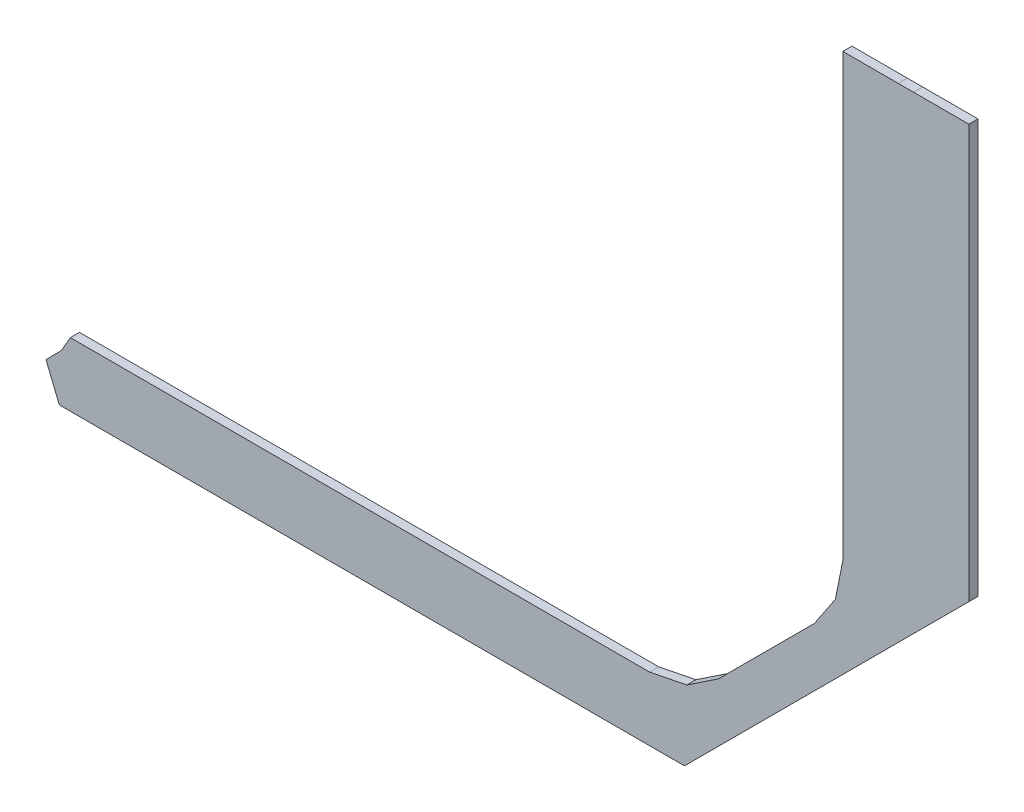
ISO-10303-21;
HEADER;
FILE_DESCRIPTION(('STEP AP214'),'2;1');
FILE_NAME('part.step','',(''),(''),'','','');
FILE_SCHEMA(('AUTOMOTIVE_DESIGN { 1 0 10303 214 1 1 1 1 }'));
ENDSEC;
DATA;
#1=APPLICATION_CONTEXT('core data for automotive mechanical design processes');
#2=APPLICATION_PROTOCOL_DEFINITION('international standard','automotive_design',2000,#1);
#3=PRODUCT_CONTEXT('',#1,'mechanical');
#4=PRODUCT('Part','Part','',(#3));
#5=PRODUCT_RELATED_PRODUCT_CATEGORY('part','',(#4));
#6=PRODUCT_DEFINITION_FORMATION('','',#4);
#7=PRODUCT_DEFINITION_CONTEXT('part definition',#1,'design');
#8=PRODUCT_DEFINITION('design','',#6,#7);
#9=PRODUCT_DEFINITION_SHAPE('','',#8);
#10=(LENGTH_UNIT() NAMED_UNIT(*) SI_UNIT(.MILLI.,.METRE.));
#11=(NAMED_UNIT(*) PLANE_ANGLE_UNIT() SI_UNIT($,.RADIAN.));
#12=(NAMED_UNIT(*) SI_UNIT($,.STERADIAN.) SOLID_ANGLE_UNIT());
#13=UNCERTAINTY_MEASURE_WITH_UNIT(LENGTH_MEASURE(1.E-05),#10,'distance_accuracy_value','');
#14=(GEOMETRIC_REPRESENTATION_CONTEXT(3) GLOBAL_UNCERTAINTY_ASSIGNED_CONTEXT((#13)) GLOBAL_UNIT_ASSIGNED_CONTEXT((#10,
#11,#12)) REPRESENTATION_CONTEXT('',''));
#15=CARTESIAN_POINT('',(0.,0.,0.));
#16=DIRECTION('',(0.,0.,1.));
#17=DIRECTION('',(1.,0.,0.));
#18=AXIS2_PLACEMENT_3D('',#15,#16,#17);
#19=CARTESIAN_POINT('',(91.6630020141601,74.3830032348633,0.));
#20=DIRECTION('',(0.,-1.,0.));
#21=DIRECTION('',(-1.,0.,0.));
#22=AXIS2_PLACEMENT_3D('',#19,#20,#21);
#23=PLANE('',#22);
#24=DIRECTION('',(-1.,0.,0.));
#25=VECTOR('',#24,1.);
#26=CARTESIAN_POINT('',(91.6630020141601,74.3830032348633,0.03556));
#27=LINE('',#26,#25);
#28=CARTESIAN_POINT('',(91.6630020141601,74.3830032348633,0.03556));
#29=VERTEX_POINT('',#28);
#30=CARTESIAN_POINT('',(91.4469985961914,74.3830032348633,0.03556));
#31=VERTEX_POINT('',#30);
#32=EDGE_CURVE('E11',#29,#31,#27,.T.);
#33=ORIENTED_EDGE('',*,*,#32,.F.);
#34=DIRECTION('',(0.,0.,1.));
#35=VECTOR('',#34,1.);
#36=CARTESIAN_POINT('',(91.6630020141601,74.3830032348633,0.));
#37=LINE('',#36,#35);
#38=CARTESIAN_POINT('',(91.6630020141601,74.3830032348633,0.));
#39=VERTEX_POINT('',#38);
#40=EDGE_CURVE('E24',#39,#29,#37,.T.);
#41=ORIENTED_EDGE('',*,*,#40,.F.);
#42=DIRECTION('',(-1.,0.,0.));
#43=VECTOR('',#42,1.);
#44=CARTESIAN_POINT('',(91.6630020141601,74.3830032348633,0.));
#45=LINE('',#44,#43);
#46=CARTESIAN_POINT('',(91.4469985961914,74.3830032348633,0.));
#47=VERTEX_POINT('',#46);
#48=EDGE_CURVE('E148',#39,#47,#45,.T.);
#49=ORIENTED_EDGE('',*,*,#48,.T.);
#50=DIRECTION('',(0.,0.,1.));
#51=VECTOR('',#50,1.);
#52=CARTESIAN_POINT('',(91.4469985961914,74.3830032348633,0.));
#53=LINE('',#52,#51);
#54=EDGE_CURVE('E37',#47,#31,#53,.T.);
#55=ORIENTED_EDGE('',*,*,#54,.T.);
#56=EDGE_LOOP('',(#33,#41,#49,#55));
#57=FACE_BOUND('',#56,.T.);
#58=ADVANCED_FACE('F17',(#57),#23,.F.);
#59=CARTESIAN_POINT('',(91.4469985961914,74.3830032348633,0.));
#60=DIRECTION('',(0.,-1.,0.));
#61=DIRECTION('',(-1.,0.,0.));
#62=AXIS2_PLACEMENT_3D('',#59,#60,#61);
#63=PLANE('',#62);
#64=DIRECTION('',(-1.,0.,0.));
#65=VECTOR('',#64,1.);
#66=CARTESIAN_POINT('',(91.4469985961914,74.3830032348633,0.03556));
#67=LINE('',#66,#65);
#68=CARTESIAN_POINT('',(91.3870010375977,74.3830032348633,0.03556));
#69=VERTEX_POINT('',#68);
#70=EDGE_CURVE('E252',#31,#69,#67,.T.);
#71=ORIENTED_EDGE('',*,*,#70,.F.);
#72=ORIENTED_EDGE('',*,*,#54,.F.);
#73=DIRECTION('',(-1.,0.,0.));
#74=VECTOR('',#73,1.);
#75=CARTESIAN_POINT('',(91.4469985961914,74.3830032348633,0.));
#76=LINE('',#75,#74);
#77=CARTESIAN_POINT('',(91.3870010375977,74.3830032348633,0.));
#78=VERTEX_POINT('',#77);
#79=EDGE_CURVE('E249',#47,#78,#76,.T.);
#80=ORIENTED_EDGE('',*,*,#79,.T.);
#81=DIRECTION('',(0.,0.,1.));
#82=VECTOR('',#81,1.);
#83=CARTESIAN_POINT('',(91.3870010375977,74.3830032348633,0.));
#84=LINE('',#83,#82);
#85=EDGE_CURVE('E247',#78,#69,#84,.T.);
#86=ORIENTED_EDGE('',*,*,#85,.T.);
#87=EDGE_LOOP('',(#71,#72,#80,#86));
#88=FACE_BOUND('',#87,.T.);
#89=ADVANCED_FACE('F260',(#88),#63,.F.);
#90=CARTESIAN_POINT('',(91.3870010375977,74.3830032348633,0.));
#91=DIRECTION('',(0.,-1.,0.));
#92=DIRECTION('',(-1.,0.,0.));
#93=AXIS2_PLACEMENT_3D('',#90,#91,#92);
#94=PLANE('',#93);
#95=DIRECTION('',(-1.,0.,0.));
#96=VECTOR('',#95,1.);
#97=CARTESIAN_POINT('',(91.3870010375977,74.3830032348633,0.03556));
#98=LINE('',#97,#96);
#99=CARTESIAN_POINT('',(91.1709976196289,74.3830032348633,0.03556));
#100=VERTEX_POINT('',#99);
#101=EDGE_CURVE('E244',#69,#100,#98,.T.);
#102=ORIENTED_EDGE('',*,*,#101,.F.);
#103=ORIENTED_EDGE('',*,*,#85,.F.);
#104=DIRECTION('',(-1.,0.,0.));
#105=VECTOR('',#104,1.);
#106=CARTESIAN_POINT('',(91.3870010375977,74.3830032348633,0.));
#107=LINE('',#106,#105);
#108=CARTESIAN_POINT('',(91.1709976196289,74.3830032348633,0.));
#109=VERTEX_POINT('',#108);
#110=EDGE_CURVE('E241',#78,#109,#107,.T.);
#111=ORIENTED_EDGE('',*,*,#110,.T.);
#112=DIRECTION('',(0.,0.,1.));
#113=VECTOR('',#112,1.);
#114=CARTESIAN_POINT('',(91.1709976196289,74.3830032348633,0.));
#115=LINE('',#114,#113);
#116=EDGE_CURVE('E239',#109,#100,#115,.T.);
#117=ORIENTED_EDGE('',*,*,#116,.T.);
#118=EDGE_LOOP('',(#102,#103,#111,#117));
#119=FACE_BOUND('',#118,.T.);
#120=ADVANCED_FACE('F266',(#119),#94,.F.);
#121=CARTESIAN_POINT('',(91.1709976196289,74.3830032348633,0.));
#122=DIRECTION('',(1.,0.,0.));
#123=DIRECTION('',(0.,-1.,0.));
#124=AXIS2_PLACEMENT_3D('',#121,#122,#123);
#125=PLANE('',#124);
#126=DIRECTION('',(0.,-1.,0.));
#127=VECTOR('',#126,1.);
#128=CARTESIAN_POINT('',(91.1709976196289,74.3830032348633,0.03556));
#129=LINE('',#128,#127);
#130=CARTESIAN_POINT('',(91.1709976196289,72.6620025634766,0.03556));
#131=VERTEX_POINT('',#130);
#132=EDGE_CURVE('E236',#100,#131,#129,.T.);
#133=ORIENTED_EDGE('',*,*,#132,.F.);
#134=ORIENTED_EDGE('',*,*,#116,.F.);
#135=DIRECTION('',(0.,-1.,0.));
#136=VECTOR('',#135,1.);
#137=CARTESIAN_POINT('',(91.1709976196289,74.3830032348633,0.));
#138=LINE('',#137,#136);
#139=CARTESIAN_POINT('',(91.1709976196289,72.6620025634766,0.));
#140=VERTEX_POINT('',#139);
#141=EDGE_CURVE('E233',#109,#140,#138,.T.);
#142=ORIENTED_EDGE('',*,*,#141,.T.);
#143=DIRECTION('',(0.,0.,1.));
#144=VECTOR('',#143,1.);
#145=CARTESIAN_POINT('',(91.1709976196289,72.6620025634766,0.));
#146=LINE('',#145,#144);
#147=EDGE_CURVE('E231',#140,#131,#146,.T.);
#148=ORIENTED_EDGE('',*,*,#147,.T.);
#149=EDGE_LOOP('',(#133,#134,#142,#148));
#150=FACE_BOUND('',#149,.T.);
#151=ADVANCED_FACE('F268',(#150),#125,.F.);
#152=CARTESIAN_POINT('',(91.1709976196289,72.6620025634766,0.));
#153=DIRECTION('',(0.980582659999227,-0.196106213335634,0.));
#154=DIRECTION('',(-0.196106213335634,-0.980582659999227,0.));
#155=AXIS2_PLACEMENT_3D('',#152,#153,#154);
#156=PLANE('',#155);
#157=DIRECTION('',(-0.196106213335634,-0.980582659999227,0.));
#158=VECTOR('',#157,1.);
#159=CARTESIAN_POINT('',(91.1709976196289,72.6620025634766,0.03556));
#160=LINE('',#159,#158);
#161=CARTESIAN_POINT('',(91.1419982910156,72.5169982910156,0.03556));
#162=VERTEX_POINT('',#161);
#163=EDGE_CURVE('E228',#131,#162,#160,.T.);
#164=ORIENTED_EDGE('',*,*,#163,.F.);
#165=ORIENTED_EDGE('',*,*,#147,.F.);
#166=DIRECTION('',(-0.196106213335634,-0.980582659999227,0.));
#167=VECTOR('',#166,1.);
#168=CARTESIAN_POINT('',(91.1709976196289,72.6620025634766,0.));
#169=LINE('',#168,#167);
#170=CARTESIAN_POINT('',(91.1419982910156,72.5169982910156,0.));
#171=VERTEX_POINT('',#170);
#172=EDGE_CURVE('E225',#140,#171,#169,.T.);
#173=ORIENTED_EDGE('',*,*,#172,.T.);
#174=DIRECTION('',(0.,0.,1.));
#175=VECTOR('',#174,1.);
#176=CARTESIAN_POINT('',(91.1419982910156,72.5169982910156,0.));
#177=LINE('',#176,#175);
#178=EDGE_CURVE('E223',#171,#162,#177,.T.);
#179=ORIENTED_EDGE('',*,*,#178,.T.);
#180=EDGE_LOOP('',(#164,#165,#173,#179));
#181=FACE_BOUND('',#180,.T.);
#182=ADVANCED_FACE('F273',(#181),#156,.F.);
#183=CARTESIAN_POINT('',(91.1419982910156,72.5169982910156,0.));
#184=DIRECTION('',(0.832050294337844,-0.554700196225229,0.));
#185=DIRECTION('',(-0.554700196225229,-0.832050294337844,0.));
#186=AXIS2_PLACEMENT_3D('',#183,#184,#185);
#187=PLANE('',#186);
#188=DIRECTION('',(-0.554700196225229,-0.832050294337844,0.));
#189=VECTOR('',#188,1.);
#190=CARTESIAN_POINT('',(91.1419982910156,72.5169982910156,0.03556));
#191=LINE('',#190,#189);
#192=CARTESIAN_POINT('',(91.0599975585938,72.3939971923828,0.03556));
#193=VERTEX_POINT('',#192);
#194=EDGE_CURVE('E220',#162,#193,#191,.T.);
#195=ORIENTED_EDGE('',*,*,#194,.F.);
#196=ORIENTED_EDGE('',*,*,#178,.F.);
#197=DIRECTION('',(-0.554700196225229,-0.832050294337844,0.));
#198=VECTOR('',#197,1.);
#199=CARTESIAN_POINT('',(91.1419982910156,72.5169982910156,0.));
#200=LINE('',#199,#198);
#201=CARTESIAN_POINT('',(91.0599975585938,72.3939971923828,0.));
#202=VERTEX_POINT('',#201);
#203=EDGE_CURVE('E217',#171,#202,#200,.T.);
#204=ORIENTED_EDGE('',*,*,#203,.T.);
#205=DIRECTION('',(0.,0.,1.));
#206=VECTOR('',#205,1.);
#207=CARTESIAN_POINT('',(91.0599975585938,72.3939971923828,0.));
#208=LINE('',#207,#206);
#209=EDGE_CURVE('E215',#202,#193,#208,.T.);
#210=ORIENTED_EDGE('',*,*,#209,.T.);
#211=EDGE_LOOP('',(#195,#196,#204,#210));
#212=FACE_BOUND('',#211,.T.);
#213=ADVANCED_FACE('F276',(#212),#187,.F.);
#214=CARTESIAN_POINT('',(91.0599975585938,72.3939971923828,0.));
#215=DIRECTION('',(0.707106781186548,-0.707106781186548,0.));
#216=DIRECTION('',(-0.707106781186548,-0.707106781186548,0.));
#217=AXIS2_PLACEMENT_3D('',#214,#215,#216);
#218=PLANE('',#217);
#219=DIRECTION('',(-0.707106781186548,-0.707106781186548,0.));
#220=VECTOR('',#219,1.);
#221=CARTESIAN_POINT('',(91.0599975585938,72.3939971923828,0.03556));
#222=LINE('',#221,#220);
#223=CARTESIAN_POINT('',(90.6849975585938,72.0189971923828,0.03556));
#224=VERTEX_POINT('',#223);
#225=EDGE_CURVE('E212',#193,#224,#222,.T.);
#226=ORIENTED_EDGE('',*,*,#225,.F.);
#227=ORIENTED_EDGE('',*,*,#209,.F.);
#228=DIRECTION('',(-0.707106781186548,-0.707106781186548,0.));
#229=VECTOR('',#228,1.);
#230=CARTESIAN_POINT('',(91.0599975585938,72.3939971923828,0.));
#231=LINE('',#230,#229);
#232=CARTESIAN_POINT('',(90.6849975585938,72.0189971923828,0.));
#233=VERTEX_POINT('',#232);
#234=EDGE_CURVE('E209',#202,#233,#231,.T.);
#235=ORIENTED_EDGE('',*,*,#234,.T.);
#236=DIRECTION('',(0.,0.,1.));
#237=VECTOR('',#236,1.);
#238=CARTESIAN_POINT('',(90.6849975585938,72.0189971923828,0.));
#239=LINE('',#238,#237);
#240=EDGE_CURVE('E207',#233,#224,#239,.T.);
#241=ORIENTED_EDGE('',*,*,#240,.T.);
#242=EDGE_LOOP('',(#226,#227,#235,#241));
#243=FACE_BOUND('',#242,.T.);
#244=ADVANCED_FACE('F281',(#243),#218,.F.);
#245=CARTESIAN_POINT('',(90.6849975585938,72.0189971923828,0.));
#246=DIRECTION('',(0.554700196225229,-0.832050294337844,0.));
#247=DIRECTION('',(-0.832050294337844,-0.554700196225229,0.));
#248=AXIS2_PLACEMENT_3D('',#245,#246,#247);
#249=PLANE('',#248);
#250=DIRECTION('',(-0.832050294337844,-0.554700196225229,0.));
#251=VECTOR('',#250,1.);
#252=CARTESIAN_POINT('',(90.6849975585938,72.0189971923828,0.03556));
#253=LINE('',#252,#251);
#254=CARTESIAN_POINT('',(90.5619964599609,71.9369964599609,0.03556));
#255=VERTEX_POINT('',#254);
#256=EDGE_CURVE('E204',#224,#255,#253,.T.);
#257=ORIENTED_EDGE('',*,*,#256,.F.);
#258=ORIENTED_EDGE('',*,*,#240,.F.);
#259=DIRECTION('',(-0.832050294337844,-0.554700196225229,0.));
#260=VECTOR('',#259,1.);
#261=CARTESIAN_POINT('',(90.6849975585938,72.0189971923828,0.));
#262=LINE('',#261,#260);
#263=CARTESIAN_POINT('',(90.5619964599609,71.9369964599609,0.));
#264=VERTEX_POINT('',#263);
#265=EDGE_CURVE('E201',#233,#264,#262,.T.);
#266=ORIENTED_EDGE('',*,*,#265,.T.);
#267=DIRECTION('',(0.,0.,1.));
#268=VECTOR('',#267,1.);
#269=CARTESIAN_POINT('',(90.5619964599609,71.9369964599609,0.));
#270=LINE('',#269,#268);
#271=EDGE_CURVE('E199',#264,#255,#270,.T.);
#272=ORIENTED_EDGE('',*,*,#271,.T.);
#273=EDGE_LOOP('',(#257,#258,#266,#272));
#274=FACE_BOUND('',#273,.T.);
#275=ADVANCED_FACE('F284',(#274),#249,.F.);
#276=CARTESIAN_POINT('',(90.5619964599609,71.9369964599609,0.));
#277=DIRECTION('',(0.196116135138184,-0.98058067569092,0.));
#278=DIRECTION('',(-0.98058067569092,-0.196116135138184,0.));
#279=AXIS2_PLACEMENT_3D('',#276,#277,#278);
#280=PLANE('',#279);
#281=DIRECTION('',(-0.98058067569092,-0.196116135138184,0.));
#282=VECTOR('',#281,1.);
#283=CARTESIAN_POINT('',(90.5619964599609,71.9369964599609,0.03556));
#284=LINE('',#283,#282);
#285=CARTESIAN_POINT('',(90.4169998168945,71.9079971313477,0.03556));
#286=VERTEX_POINT('',#285);
#287=EDGE_CURVE('E196',#255,#286,#284,.T.);
#288=ORIENTED_EDGE('',*,*,#287,.F.);
#289=ORIENTED_EDGE('',*,*,#271,.F.);
#290=DIRECTION('',(-0.98058067569092,-0.196116135138184,0.));
#291=VECTOR('',#290,1.);
#292=CARTESIAN_POINT('',(90.5619964599609,71.9369964599609,0.));
#293=LINE('',#292,#291);
#294=CARTESIAN_POINT('',(90.4169998168945,71.9079971313477,0.));
#295=VERTEX_POINT('',#294);
#296=EDGE_CURVE('E193',#264,#295,#293,.T.);
#297=ORIENTED_EDGE('',*,*,#296,.T.);
#298=DIRECTION('',(0.,0.,1.));
#299=VECTOR('',#298,1.);
#300=CARTESIAN_POINT('',(90.4169998168945,71.9079971313477,0.));
#301=LINE('',#300,#299);
#302=EDGE_CURVE('E191',#295,#286,#301,.T.);
#303=ORIENTED_EDGE('',*,*,#302,.T.);
#304=EDGE_LOOP('',(#288,#289,#297,#303));
#305=FACE_BOUND('',#304,.T.);
#306=ADVANCED_FACE('F289',(#305),#280,.F.);
#307=CARTESIAN_POINT('',(90.4169998168945,71.9079971313477,0.));
#308=DIRECTION('',(0.,-1.,0.));
#309=DIRECTION('',(-1.,0.,0.));
#310=AXIS2_PLACEMENT_3D('',#307,#308,#309);
#311=PLANE('',#310);
#312=DIRECTION('',(-1.,0.,0.));
#313=VECTOR('',#312,1.);
#314=CARTESIAN_POINT('',(90.4169998168945,71.9079971313477,0.03556));
#315=LINE('',#314,#313);
#316=CARTESIAN_POINT('',(88.1559982299805,71.9079971313477,0.03556));
#317=VERTEX_POINT('',#316);
#318=EDGE_CURVE('E188',#286,#317,#315,.T.);
#319=ORIENTED_EDGE('',*,*,#318,.F.);
#320=ORIENTED_EDGE('',*,*,#302,.F.);
#321=DIRECTION('',(-1.,0.,0.));
#322=VECTOR('',#321,1.);
#323=CARTESIAN_POINT('',(90.4169998168945,71.9079971313477,0.));
#324=LINE('',#323,#322);
#325=CARTESIAN_POINT('',(88.1559982299805,71.9079971313477,0.));
#326=VERTEX_POINT('',#325);
#327=EDGE_CURVE('E185',#295,#326,#324,.T.);
#328=ORIENTED_EDGE('',*,*,#327,.T.);
#329=DIRECTION('',(0.,0.,1.));
#330=VECTOR('',#329,1.);
#331=CARTESIAN_POINT('',(88.1559982299805,71.9079971313477,0.));
#332=LINE('',#331,#330);
#333=EDGE_CURVE('E183',#326,#317,#332,.T.);
#334=ORIENTED_EDGE('',*,*,#333,.T.);
#335=EDGE_LOOP('',(#319,#320,#328,#334));
#336=FACE_BOUND('',#335,.T.);
#337=ADVANCED_FACE('F292',(#336),#311,.F.);
#338=CARTESIAN_POINT('',(88.1559982299805,71.9079971313477,0.));
#339=DIRECTION('',(0.867380587258325,-0.497645372577103,0.));
#340=DIRECTION('',(-0.497645372577103,-0.867380587258325,0.));
#341=AXIS2_PLACEMENT_3D('',#338,#339,#340);
#342=PLANE('',#341);
#343=DIRECTION('',(-0.497645372577103,-0.867380587258325,0.));
#344=VECTOR('',#343,1.);
#345=CARTESIAN_POINT('',(88.1559982299805,71.9079971313477,0.03556));
#346=LINE('',#345,#344);
#347=CARTESIAN_POINT('',(88.1210021972656,71.8470001220703,0.03556));
#348=VERTEX_POINT('',#347);
#349=EDGE_CURVE('E180',#317,#348,#346,.T.);
#350=ORIENTED_EDGE('',*,*,#349,.F.);
#351=ORIENTED_EDGE('',*,*,#333,.F.);
#352=DIRECTION('',(-0.497645372577103,-0.867380587258325,0.));
#353=VECTOR('',#352,1.);
#354=CARTESIAN_POINT('',(88.1559982299805,71.9079971313477,0.));
#355=LINE('',#354,#353);
#356=CARTESIAN_POINT('',(88.1210021972656,71.8470001220703,0.));
#357=VERTEX_POINT('',#356);
#358=EDGE_CURVE('E177',#326,#357,#355,.T.);
#359=ORIENTED_EDGE('',*,*,#358,.T.);
#360=DIRECTION('',(0.,0.,1.));
#361=VECTOR('',#360,1.);
#362=CARTESIAN_POINT('',(88.1210021972656,71.8470001220703,0.));
#363=LINE('',#362,#361);
#364=EDGE_CURVE('E175',#357,#348,#363,.T.);
#365=ORIENTED_EDGE('',*,*,#364,.T.);
#366=EDGE_LOOP('',(#350,#351,#359,#365));
#367=FACE_BOUND('',#366,.T.);
#368=ADVANCED_FACE('F297',(#367),#342,.F.);
#369=CARTESIAN_POINT('',(88.1210021972656,71.8470001220703,0.));
#370=DIRECTION('',(0.712878790988753,-0.701287265932025,0.));
#371=DIRECTION('',(-0.701287265932025,-0.712878790988753,0.));
#372=AXIS2_PLACEMENT_3D('',#369,#370,#371);
#373=PLANE('',#372);
#374=DIRECTION('',(-0.701287265932025,-0.712878790988753,0.));
#375=VECTOR('',#374,1.);
#376=CARTESIAN_POINT('',(88.1210021972656,71.8470001220703,0.03556));
#377=LINE('',#376,#375);
#378=CARTESIAN_POINT('',(88.0609970092774,71.786003112793,0.03556));
#379=VERTEX_POINT('',#378);
#380=EDGE_CURVE('E172',#348,#379,#377,.T.);
#381=ORIENTED_EDGE('',*,*,#380,.F.);
#382=ORIENTED_EDGE('',*,*,#364,.F.);
#383=DIRECTION('',(-0.701287265932025,-0.712878790988753,0.));
#384=VECTOR('',#383,1.);
#385=CARTESIAN_POINT('',(88.1210021972656,71.8470001220703,0.));
#386=LINE('',#385,#384);
#387=CARTESIAN_POINT('',(88.0609970092774,71.786003112793,0.));
#388=VERTEX_POINT('',#387);
#389=EDGE_CURVE('E169',#357,#388,#386,.T.);
#390=ORIENTED_EDGE('',*,*,#389,.T.);
#391=DIRECTION('',(0.,0.,1.));
#392=VECTOR('',#391,1.);
#393=CARTESIAN_POINT('',(88.0609970092774,71.786003112793,0.));
#394=LINE('',#393,#392);
#395=EDGE_CURVE('E167',#388,#379,#394,.T.);
#396=ORIENTED_EDGE('',*,*,#395,.T.);
#397=EDGE_LOOP('',(#381,#382,#390,#396));
#398=FACE_BOUND('',#397,.T.);
#399=ADVANCED_FACE('F300',(#398),#373,.F.);
#400=CARTESIAN_POINT('',(88.0609970092774,71.786003112793,0.));
#401=DIRECTION('',(0.92543268080878,0.378912065380708,0.));
#402=DIRECTION('',(0.378912065380708,-0.92543268080878,0.));
#403=AXIS2_PLACEMENT_3D('',#400,#401,#402);
#404=PLANE('',#403);
#405=DIRECTION('',(0.378912065380708,-0.92543268080878,0.));
#406=VECTOR('',#405,1.);
#407=CARTESIAN_POINT('',(88.0609970092774,71.786003112793,0.03556));
#408=LINE('',#407,#406);
#409=CARTESIAN_POINT('',(88.1129989624023,71.6589965820313,0.03556));
#410=VERTEX_POINT('',#409);
#411=EDGE_CURVE('E164',#379,#410,#408,.T.);
#412=ORIENTED_EDGE('',*,*,#411,.F.);
#413=ORIENTED_EDGE('',*,*,#395,.F.);
#414=DIRECTION('',(0.378912065380708,-0.92543268080878,0.));
#415=VECTOR('',#414,1.);
#416=CARTESIAN_POINT('',(88.0609970092774,71.786003112793,0.));
#417=LINE('',#416,#415);
#418=CARTESIAN_POINT('',(88.1129989624023,71.6589965820313,0.));
#419=VERTEX_POINT('',#418);
#420=EDGE_CURVE('E161',#388,#419,#417,.T.);
#421=ORIENTED_EDGE('',*,*,#420,.T.);
#422=DIRECTION('',(0.,0.,1.));
#423=VECTOR('',#422,1.);
#424=CARTESIAN_POINT('',(88.1129989624023,71.6589965820313,0.));
#425=LINE('',#424,#423);
#426=EDGE_CURVE('E159',#419,#410,#425,.T.);
#427=ORIENTED_EDGE('',*,*,#426,.T.);
#428=EDGE_LOOP('',(#412,#413,#421,#427));
#429=FACE_BOUND('',#428,.T.);
#430=ADVANCED_FACE('F305',(#429),#404,.F.);
#431=CARTESIAN_POINT('',(88.1129989624023,71.6589965820313,0.));
#432=DIRECTION('',(0.,1.,0.));
#433=DIRECTION('',(1.,0.,0.));
#434=AXIS2_PLACEMENT_3D('',#431,#432,#433);
#435=PLANE('',#434);
#436=DIRECTION('',(1.,0.,0.));
#437=VECTOR('',#436,1.);
#438=CARTESIAN_POINT('',(88.1129989624023,71.6589965820313,0.03556));
#439=LINE('',#438,#437);
#440=CARTESIAN_POINT('',(90.5530014038086,71.6589965820313,0.03556));
#441=VERTEX_POINT('',#440);
#442=EDGE_CURVE('E156',#410,#441,#439,.T.);
#443=ORIENTED_EDGE('',*,*,#442,.F.);
#444=ORIENTED_EDGE('',*,*,#426,.F.);
#445=DIRECTION('',(1.,0.,0.));
#446=VECTOR('',#445,1.);
#447=CARTESIAN_POINT('',(88.1129989624023,71.6589965820313,0.));
#448=LINE('',#447,#446);
#449=CARTESIAN_POINT('',(90.5530014038086,71.6589965820313,0.));
#450=VERTEX_POINT('',#449);
#451=EDGE_CURVE('E154',#419,#450,#448,.T.);
#452=ORIENTED_EDGE('',*,*,#451,.T.);
#453=DIRECTION('',(0.,0.,1.));
#454=VECTOR('',#453,1.);
#455=CARTESIAN_POINT('',(90.5530014038086,71.6589965820313,0.));
#456=LINE('',#455,#454);
#457=EDGE_CURVE('E139',#450,#441,#456,.T.);
#458=ORIENTED_EDGE('',*,*,#457,.T.);
#459=EDGE_LOOP('',(#443,#444,#452,#458));
#460=FACE_BOUND('',#459,.T.);
#461=ADVANCED_FACE('F307',(#460),#435,.F.);
#462=CARTESIAN_POINT('',(90.5530014038086,71.6589965820313,0.));
#463=DIRECTION('',(-0.707106781186548,0.707106781186548,0.));
#464=DIRECTION('',(0.707106781186548,0.707106781186548,0.));
#465=AXIS2_PLACEMENT_3D('',#462,#463,#464);
#466=PLANE('',#465);
#467=DIRECTION('',(0.707106781186548,0.707106781186548,0.));
#468=VECTOR('',#467,1.);
#469=CARTESIAN_POINT('',(90.5530014038086,71.6589965820313,0.03556));
#470=LINE('',#469,#468);
#471=CARTESIAN_POINT('',(91.6630020141601,72.7689971923828,0.03556));
#472=VERTEX_POINT('',#471);
#473=EDGE_CURVE('E143',#441,#472,#470,.T.);
#474=ORIENTED_EDGE('',*,*,#473,.F.);
#475=ORIENTED_EDGE('',*,*,#457,.F.);
#476=DIRECTION('',(0.707106781186548,0.707106781186548,0.));
#477=VECTOR('',#476,1.);
#478=CARTESIAN_POINT('',(90.5530014038086,71.6589965820313,0.));
#479=LINE('',#478,#477);
#480=CARTESIAN_POINT('',(91.6630020141601,72.7689971923828,0.));
#481=VERTEX_POINT('',#480);
#482=EDGE_CURVE('E135',#450,#481,#479,.T.);
#483=ORIENTED_EDGE('',*,*,#482,.T.);
#484=DIRECTION('',(0.,0.,1.));
#485=VECTOR('',#484,1.);
#486=CARTESIAN_POINT('',(91.6630020141601,72.7689971923828,0.));
#487=LINE('',#486,#485);
#488=EDGE_CURVE('E125',#481,#472,#487,.T.);
#489=ORIENTED_EDGE('',*,*,#488,.T.);
#490=EDGE_LOOP('',(#474,#475,#483,#489));
#491=FACE_BOUND('',#490,.T.);
#492=ADVANCED_FACE('F138',(#491),#466,.F.);
#493=CARTESIAN_POINT('',(91.6630020141601,72.7689971923828,0.));
#494=DIRECTION('',(-1.,0.,0.));
#495=DIRECTION('',(0.,1.,0.));
#496=AXIS2_PLACEMENT_3D('',#493,#494,#495);
#497=PLANE('',#496);
#498=DIRECTION('',(0.,1.,0.));
#499=VECTOR('',#498,1.);
#500=CARTESIAN_POINT('',(91.6630020141601,72.7689971923828,0.03556));
#501=LINE('',#500,#499);
#502=EDGE_CURVE('E131',#472,#29,#501,.T.);
#503=ORIENTED_EDGE('',*,*,#502,.F.);
#504=ORIENTED_EDGE('',*,*,#488,.F.);
#505=DIRECTION('',(0.,1.,0.));
#506=VECTOR('',#505,1.);
#507=CARTESIAN_POINT('',(91.6630020141601,72.7689971923828,0.));
#508=LINE('',#507,#506);
#509=EDGE_CURVE('E129',#481,#39,#508,.T.);
#510=ORIENTED_EDGE('',*,*,#509,.T.);
#511=ORIENTED_EDGE('',*,*,#40,.T.);
#512=EDGE_LOOP('',(#503,#504,#510,#511));
#513=FACE_BOUND('',#512,.T.);
#514=ADVANCED_FACE('F127',(#513),#497,.F.);
#515=CARTESIAN_POINT('',(91.6630020141601,74.3830032348633,0.));
#516=DIRECTION('',(0.,0.,-1.));
#517=DIRECTION('',(-1.,0.,0.));
#518=AXIS2_PLACEMENT_3D('',#515,#516,#517);
#519=PLANE('',#518);
#520=ORIENTED_EDGE('',*,*,#509,.F.);
#521=ORIENTED_EDGE('',*,*,#482,.F.);
#522=ORIENTED_EDGE('',*,*,#451,.F.);
#523=ORIENTED_EDGE('',*,*,#420,.F.);
#524=ORIENTED_EDGE('',*,*,#389,.F.);
#525=ORIENTED_EDGE('',*,*,#358,.F.);
#526=ORIENTED_EDGE('',*,*,#327,.F.);
#527=ORIENTED_EDGE('',*,*,#296,.F.);
#528=ORIENTED_EDGE('',*,*,#265,.F.);
#529=ORIENTED_EDGE('',*,*,#234,.F.);
#530=ORIENTED_EDGE('',*,*,#203,.F.);
#531=ORIENTED_EDGE('',*,*,#172,.F.);
#532=ORIENTED_EDGE('',*,*,#141,.F.);
#533=ORIENTED_EDGE('',*,*,#110,.F.);
#534=ORIENTED_EDGE('',*,*,#79,.F.);
#535=ORIENTED_EDGE('',*,*,#48,.F.);
#536=EDGE_LOOP('',(#520,#521,#522,#523,#524,#525,#526,#527,#528,#529,#530,#531,#532,#533,#534,#535));
#537=FACE_BOUND('',#536,.T.);
#538=ADVANCED_FACE('F146',(#537),#519,.T.);
#539=CARTESIAN_POINT('',(91.6630020141601,74.3830032348633,0.03556));
#540=DIRECTION('',(0.,0.,-1.));
#541=DIRECTION('',(-1.,0.,0.));
#542=AXIS2_PLACEMENT_3D('',#539,#540,#541);
#543=PLANE('',#542);
#544=ORIENTED_EDGE('',*,*,#32,.T.);
#545=ORIENTED_EDGE('',*,*,#70,.T.);
#546=ORIENTED_EDGE('',*,*,#101,.T.);
#547=ORIENTED_EDGE('',*,*,#132,.T.);
#548=ORIENTED_EDGE('',*,*,#163,.T.);
#549=ORIENTED_EDGE('',*,*,#194,.T.);
#550=ORIENTED_EDGE('',*,*,#225,.T.);
#551=ORIENTED_EDGE('',*,*,#256,.T.);
#552=ORIENTED_EDGE('',*,*,#287,.T.);
#553=ORIENTED_EDGE('',*,*,#318,.T.);
#554=ORIENTED_EDGE('',*,*,#349,.T.);
#555=ORIENTED_EDGE('',*,*,#380,.T.);
#556=ORIENTED_EDGE('',*,*,#411,.T.);
#557=ORIENTED_EDGE('',*,*,#442,.T.);
#558=ORIENTED_EDGE('',*,*,#473,.T.);
#559=ORIENTED_EDGE('',*,*,#502,.T.);
#560=EDGE_LOOP('',(#544,#545,#546,#547,#548,#549,#550,#551,#552,#553,#554,#555,#556,#557,#558,#559));
#561=FACE_BOUND('',#560,.T.);
#562=ADVANCED_FACE('F263',(#561),#543,.F.);
#563=CLOSED_SHELL('',(#58,#89,#120,#151,#182,#213,#244,#275,#306,#337,#368,#399,#430,#461,#492,
#514,#538,#562));
#564=MANIFOLD_SOLID_BREP('B1',#563);
#565=ADVANCED_BREP_SHAPE_REPRESENTATION('',(#18,#564),#14);
#566=SHAPE_DEFINITION_REPRESENTATION(#9,#565);
ENDSEC;
END-ISO-10303-21;
